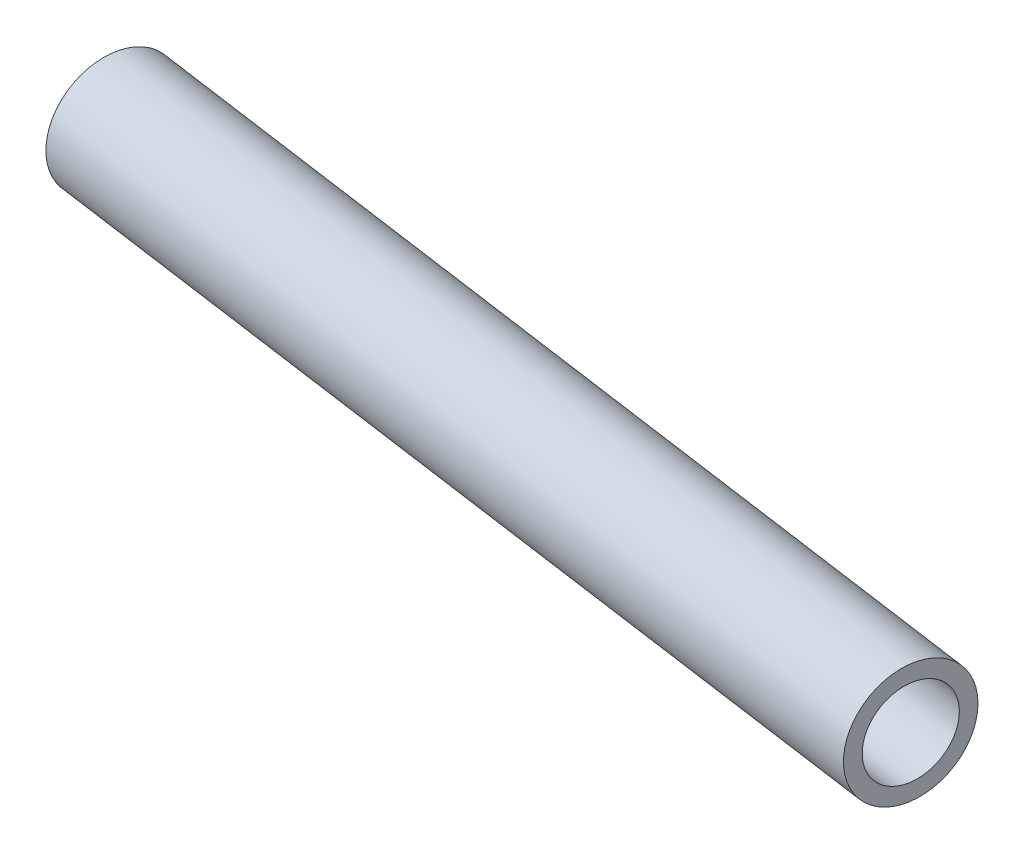
ISO-10303-21;
HEADER;
FILE_DESCRIPTION(('STEP AP214'),'2;1');
FILE_NAME('part.step','',(''),(''),'','','');
FILE_SCHEMA(('AUTOMOTIVE_DESIGN { 1 0 10303 214 1 1 1 1 }'));
ENDSEC;
DATA;
#1=APPLICATION_CONTEXT('core data for automotive mechanical design processes');
#2=APPLICATION_PROTOCOL_DEFINITION('international standard','automotive_design',2000,#1);
#3=PRODUCT_CONTEXT('',#1,'mechanical');
#4=PRODUCT('Part','Part','',(#3));
#5=PRODUCT_RELATED_PRODUCT_CATEGORY('part','',(#4));
#6=PRODUCT_DEFINITION_FORMATION('','',#4);
#7=PRODUCT_DEFINITION_CONTEXT('part definition',#1,'design');
#8=PRODUCT_DEFINITION('design','',#6,#7);
#9=PRODUCT_DEFINITION_SHAPE('','',#8);
#10=(LENGTH_UNIT() NAMED_UNIT(*) SI_UNIT(.MILLI.,.METRE.));
#11=(NAMED_UNIT(*) PLANE_ANGLE_UNIT() SI_UNIT($,.RADIAN.));
#12=(NAMED_UNIT(*) SI_UNIT($,.STERADIAN.) SOLID_ANGLE_UNIT());
#13=UNCERTAINTY_MEASURE_WITH_UNIT(LENGTH_MEASURE(1.E-05),#10,'distance_accuracy_value','');
#14=(GEOMETRIC_REPRESENTATION_CONTEXT(3) GLOBAL_UNCERTAINTY_ASSIGNED_CONTEXT((#13)) GLOBAL_UNIT_ASSIGNED_CONTEXT((#10,
#11,#12)) REPRESENTATION_CONTEXT('',''));
#15=CARTESIAN_POINT('',(0.,0.,0.));
#16=DIRECTION('',(0.,0.,1.));
#17=DIRECTION('',(1.,0.,0.));
#18=AXIS2_PLACEMENT_3D('',#15,#16,#17);
#19=CARTESIAN_POINT('',(-75.1876778744294,-23.74921875,-377.170892764948));
#20=DIRECTION('',(0.990268068741571,0.,0.139173100960058));
#21=DIRECTION('',(0.139173100960058,0.,-0.990268068741571));
#22=AXIS2_PLACEMENT_3D('',#19,#20,#21);
#23=CYLINDRICAL_SURFACE('',#22,5.40078125000756);
#24=CARTESIAN_POINT('',(-75.1876778744294,-23.74921875,-377.170892764948));
#25=DIRECTION('',(0.990268068741571,0.,0.139173100960058));
#26=DIRECTION('',(0.139173100960058,0.,-0.990268068741571));
#27=AXIS2_PLACEMENT_3D('',#24,#25,#26);
#28=CIRCLE('',#27,5.40078125000756);
#29=CARTESIAN_POINT('',(-74.4360344002589,-23.74921875,-382.519113983089));
#30=VERTEX_POINT('',#29);
#31=EDGE_CURVE('E11',#30,#30,#28,.T.);
#32=ORIENTED_EDGE('',*,*,#31,.T.);
#33=EDGE_LOOP('',(#32));
#34=FACE_BOUND('',#33,.T.);
#35=CARTESIAN_POINT('',(8.98510796860419,-23.74921875,-365.341179183344));
#36=DIRECTION('',(0.990268068741571,0.,0.139173100960058));
#37=DIRECTION('',(0.139173100960058,0.,-0.990268068741571));
#38=AXIS2_PLACEMENT_3D('',#35,#36,#37);
#39=CIRCLE('',#38,5.40078125000756);
#40=CARTESIAN_POINT('',(9.73675144277468,-23.74921875,-370.689400401484));
#41=VERTEX_POINT('',#40);
#42=EDGE_CURVE('E48',#41,#41,#39,.T.);
#43=ORIENTED_EDGE('',*,*,#42,.F.);
#44=EDGE_LOOP('',(#43));
#45=FACE_BOUND('',#44,.T.);
#46=ADVANCED_FACE('F45',(#34,#45),#23,.T.);
#47=CARTESIAN_POINT('',(-75.1876778744294,-23.74921875,-377.170892764948));
#48=DIRECTION('',(0.990268068741571,0.,0.139173100960058));
#49=DIRECTION('',(0.139173100960058,0.,-0.990268068741571));
#50=AXIS2_PLACEMENT_3D('',#47,#48,#49);
#51=PLANE('',#50);
#52=CARTESIAN_POINT('',(-75.1876778744294,-23.74921875,-377.170892764948));
#53=DIRECTION('',(0.990268068741571,0.,0.139173100960058));
#54=DIRECTION('',(0.139173100960058,0.,-0.990268068741571));
#55=AXIS2_PLACEMENT_3D('',#52,#53,#54);
#56=CIRCLE('',#55,3.90078125000752);
#57=CARTESIAN_POINT('',(-74.644794051699,-23.74921875,-381.033711879977));
#58=VERTEX_POINT('',#57);
#59=EDGE_CURVE('E55',#58,#58,#56,.T.);
#60=ORIENTED_EDGE('',*,*,#59,.T.);
#61=EDGE_LOOP('',(#60));
#62=FACE_BOUND('',#61,.T.);
#63=ORIENTED_EDGE('',*,*,#31,.F.);
#64=EDGE_LOOP('',(#63));
#65=FACE_BOUND('',#64,.T.);
#66=ADVANCED_FACE('F63',(#62,#65),#51,.F.);
#67=CARTESIAN_POINT('',(8.98510796860419,-23.74921875,-365.341179183344));
#68=DIRECTION('',(0.990268068741571,0.,0.139173100960058));
#69=DIRECTION('',(0.139173100960058,0.,-0.990268068741571));
#70=AXIS2_PLACEMENT_3D('',#67,#68,#69);
#71=PLANE('',#70);
#72=CARTESIAN_POINT('',(8.98510796860419,-23.74921875,-365.341179183344));
#73=DIRECTION('',(0.990268068741571,0.,0.139173100960058));
#74=DIRECTION('',(0.139173100960058,0.,-0.990268068741571));
#75=AXIS2_PLACEMENT_3D('',#72,#73,#74);
#76=CIRCLE('',#75,3.90078125000752);
#77=CARTESIAN_POINT('',(9.52799179133459,-23.74921875,-369.203998298372));
#78=VERTEX_POINT('',#77);
#79=EDGE_CURVE('E57',#78,#78,#76,.T.);
#80=ORIENTED_EDGE('',*,*,#79,.F.);
#81=EDGE_LOOP('',(#80));
#82=FACE_BOUND('',#81,.T.);
#83=ORIENTED_EDGE('',*,*,#42,.T.);
#84=EDGE_LOOP('',(#83));
#85=FACE_BOUND('',#84,.T.);
#86=ADVANCED_FACE('F69',(#82,#85),#71,.T.);
#87=CARTESIAN_POINT('',(-75.1876778744294,-23.74921875,-377.170892764948));
#88=DIRECTION('',(0.990268068741571,0.,0.139173100960058));
#89=DIRECTION('',(0.139173100960058,0.,-0.990268068741571));
#90=AXIS2_PLACEMENT_3D('',#87,#88,#89);
#91=CYLINDRICAL_SURFACE('',#90,3.90078125000752);
#92=ORIENTED_EDGE('',*,*,#59,.F.);
#93=EDGE_LOOP('',(#92));
#94=FACE_BOUND('',#93,.T.);
#95=ORIENTED_EDGE('',*,*,#79,.T.);
#96=EDGE_LOOP('',(#95));
#97=FACE_BOUND('',#96,.T.);
#98=ADVANCED_FACE('F66',(#94,#97),#91,.F.);
#99=CLOSED_SHELL('',(#46,#66,#86,#98));
#100=MANIFOLD_SOLID_BREP('B2',#99);
#101=ADVANCED_BREP_SHAPE_REPRESENTATION('',(#18,#100),#14);
#102=SHAPE_DEFINITION_REPRESENTATION(#9,#101);
ENDSEC;
END-ISO-10303-21;
